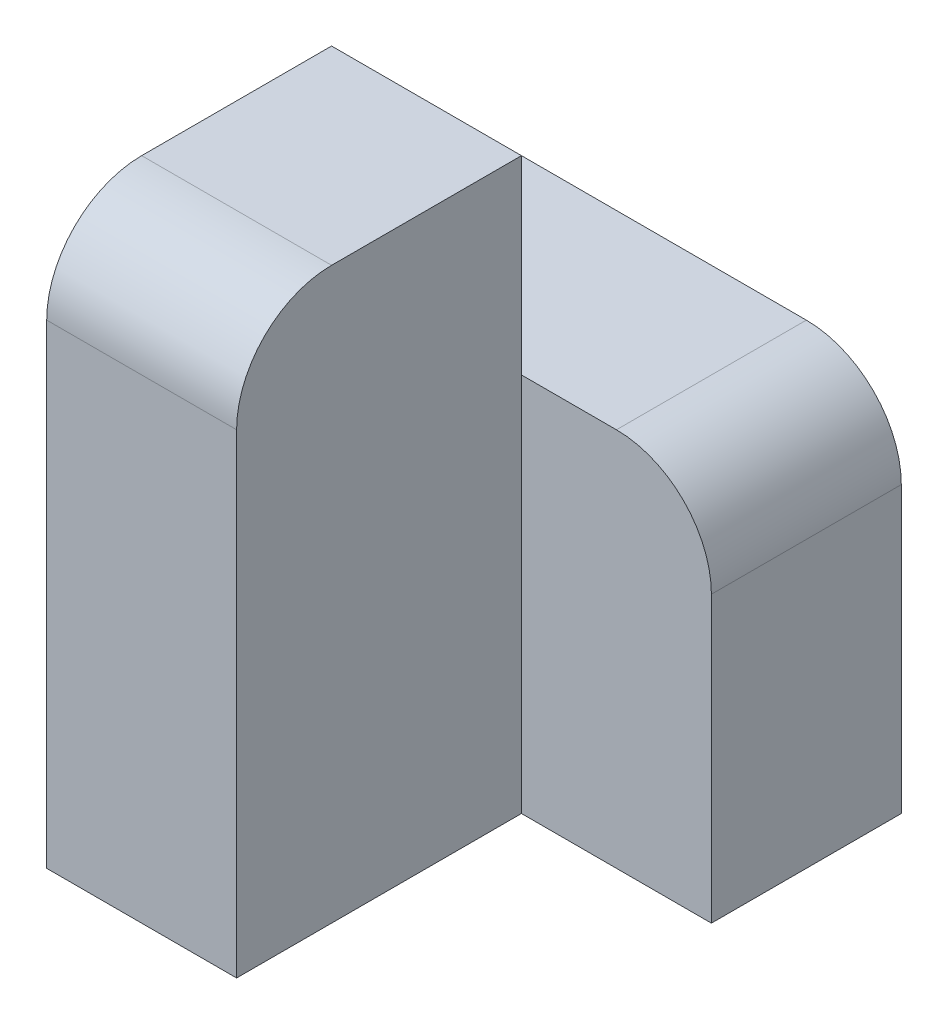
ISO-10303-21;
HEADER;
FILE_DESCRIPTION(('STEP AP214'),'2;1');
FILE_NAME('part.step','',(''),(''),'','','');
FILE_SCHEMA(('AUTOMOTIVE_DESIGN { 1 0 10303 214 1 1 1 1 }'));
ENDSEC;
DATA;
#1=APPLICATION_CONTEXT('core data for automotive mechanical design processes');
#2=APPLICATION_PROTOCOL_DEFINITION('international standard','automotive_design',2000,#1);
#3=PRODUCT_CONTEXT('',#1,'mechanical');
#4=PRODUCT('Part','Part','',(#3));
#5=PRODUCT_RELATED_PRODUCT_CATEGORY('part','',(#4));
#6=PRODUCT_DEFINITION_FORMATION('','',#4);
#7=PRODUCT_DEFINITION_CONTEXT('part definition',#1,'design');
#8=PRODUCT_DEFINITION('design','',#6,#7);
#9=PRODUCT_DEFINITION_SHAPE('','',#8);
#10=(LENGTH_UNIT() NAMED_UNIT(*) SI_UNIT(.MILLI.,.METRE.));
#11=(NAMED_UNIT(*) PLANE_ANGLE_UNIT() SI_UNIT($,.RADIAN.));
#12=(NAMED_UNIT(*) SI_UNIT($,.STERADIAN.) SOLID_ANGLE_UNIT());
#13=UNCERTAINTY_MEASURE_WITH_UNIT(LENGTH_MEASURE(1.E-05),#10,'distance_accuracy_value','');
#14=(GEOMETRIC_REPRESENTATION_CONTEXT(3) GLOBAL_UNCERTAINTY_ASSIGNED_CONTEXT((#13)) GLOBAL_UNIT_ASSIGNED_CONTEXT((#10,
#11,#12)) REPRESENTATION_CONTEXT('',''));
#15=CARTESIAN_POINT('',(0.,0.,0.));
#16=DIRECTION('',(0.,0.,1.));
#17=DIRECTION('',(1.,0.,0.));
#18=AXIS2_PLACEMENT_3D('',#15,#16,#17);
#19=CARTESIAN_POINT('',(-10.,0.,30.));
#20=DIRECTION('',(0.,-1.,0.));
#21=DIRECTION('',(1.,0.,0.));
#22=AXIS2_PLACEMENT_3D('',#19,#20,#21);
#23=PLANE('',#22);
#24=DIRECTION('',(0.,0.,-1.));
#25=VECTOR('',#24,1.);
#26=CARTESIAN_POINT('',(-30.,0.,30.));
#27=LINE('',#26,#25);
#28=CARTESIAN_POINT('',(-30.,0.,20.));
#29=VERTEX_POINT('',#28);
#30=CARTESIAN_POINT('',(-30.,0.,0.));
#31=VERTEX_POINT('',#30);
#32=EDGE_CURVE('E171',#29,#31,#27,.T.);
#33=ORIENTED_EDGE('',*,*,#32,.F.);
#34=DIRECTION('',(-1.,0.,0.));
#35=VECTOR('',#34,1.);
#36=CARTESIAN_POINT('',(-10.,0.,20.));
#37=LINE('',#36,#35);
#38=CARTESIAN_POINT('',(-10.,0.,20.));
#39=VERTEX_POINT('',#38);
#40=EDGE_CURVE('E43',#29,#39,#37,.F.);
#41=ORIENTED_EDGE('',*,*,#40,.T.);
#42=DIRECTION('',(0.,0.,-1.));
#43=VECTOR('',#42,1.);
#44=CARTESIAN_POINT('',(-10.,0.,30.));
#45=LINE('',#44,#43);
#46=CARTESIAN_POINT('',(-10.,0.,0.));
#47=VERTEX_POINT('',#46);
#48=EDGE_CURVE('E158',#39,#47,#45,.T.);
#49=ORIENTED_EDGE('',*,*,#48,.T.);
#50=DIRECTION('',(-1.,0.,0.));
#51=VECTOR('',#50,1.);
#52=CARTESIAN_POINT('',(-10.,0.,0.));
#53=LINE('',#52,#51);
#54=EDGE_CURVE('E148',#47,#31,#53,.T.);
#55=ORIENTED_EDGE('',*,*,#54,.T.);
#56=EDGE_LOOP('',(#33,#41,#49,#55));
#57=FACE_BOUND('',#56,.T.);
#58=ADVANCED_FACE('F35',(#57),#23,.F.);
#59=CARTESIAN_POINT('',(-30.,0.,30.));
#60=DIRECTION('',(1.,0.,0.));
#61=DIRECTION('',(0.,0.,-1.));
#62=AXIS2_PLACEMENT_3D('',#59,#60,#61);
#63=PLANE('',#62);
#64=DIRECTION('',(0.,-1.,0.));
#65=VECTOR('',#64,1.);
#66=CARTESIAN_POINT('',(-30.,0.,30.));
#67=LINE('',#66,#65);
#68=CARTESIAN_POINT('',(-30.,-10.,30.));
#69=VERTEX_POINT('',#68);
#70=CARTESIAN_POINT('',(-30.,-60.,30.));
#71=VERTEX_POINT('',#70);
#72=EDGE_CURVE('E150',#69,#71,#67,.T.);
#73=ORIENTED_EDGE('',*,*,#72,.F.);
#74=CARTESIAN_POINT('',(-30.,-10.,20.));
#75=DIRECTION('',(1.,0.,0.));
#76=DIRECTION('',(0.,0.,-1.));
#77=AXIS2_PLACEMENT_3D('',#74,#75,#76);
#78=CIRCLE('',#77,10.);
#79=EDGE_CURVE('E57',#69,#29,#78,.F.);
#80=ORIENTED_EDGE('',*,*,#79,.T.);
#81=ORIENTED_EDGE('',*,*,#32,.T.);
#82=DIRECTION('',(0.,-1.,0.));
#83=VECTOR('',#82,1.);
#84=CARTESIAN_POINT('',(-30.,0.,0.));
#85=LINE('',#84,#83);
#86=CARTESIAN_POINT('',(-30.,-20.,0.));
#87=VERTEX_POINT('',#86);
#88=EDGE_CURVE('E126',#31,#87,#85,.T.);
#89=ORIENTED_EDGE('',*,*,#88,.T.);
#90=DIRECTION('',(0.,0.,1.));
#91=VECTOR('',#90,1.);
#92=CARTESIAN_POINT('',(-30.,-20.,-20.));
#93=LINE('',#92,#91);
#94=CARTESIAN_POINT('',(-30.,-20.,-20.));
#95=VERTEX_POINT('',#94);
#96=EDGE_CURVE('E111',#95,#87,#93,.T.);
#97=ORIENTED_EDGE('',*,*,#96,.F.);
#98=DIRECTION('',(0.,-1.,0.));
#99=VECTOR('',#98,1.);
#100=CARTESIAN_POINT('',(-30.,-20.,-20.));
#101=LINE('',#100,#99);
#102=CARTESIAN_POINT('',(-30.,-60.,-20.));
#103=VERTEX_POINT('',#102);
#104=EDGE_CURVE('E118',#95,#103,#101,.T.);
#105=ORIENTED_EDGE('',*,*,#104,.T.);
#106=DIRECTION('',(0.,0.,-1.));
#107=VECTOR('',#106,1.);
#108=CARTESIAN_POINT('',(-30.,-60.,30.));
#109=LINE('',#108,#107);
#110=EDGE_CURVE('E169',#71,#103,#109,.T.);
#111=ORIENTED_EDGE('',*,*,#110,.F.);
#112=EDGE_LOOP('',(#73,#80,#81,#89,#97,#105,#111));
#113=FACE_BOUND('',#112,.T.);
#114=ADVANCED_FACE('F123',(#113),#63,.F.);
#115=CARTESIAN_POINT('',(-30.,-60.,30.));
#116=DIRECTION('',(0.,1.,0.));
#117=DIRECTION('',(0.,0.,1.));
#118=AXIS2_PLACEMENT_3D('',#115,#116,#117);
#119=PLANE('',#118);
#120=ORIENTED_EDGE('',*,*,#110,.T.);
#121=DIRECTION('',(1.,0.,0.));
#122=VECTOR('',#121,1.);
#123=CARTESIAN_POINT('',(-30.,-60.,-20.));
#124=LINE('',#123,#122);
#125=CARTESIAN_POINT('',(10.,-60.,-20.));
#126=VERTEX_POINT('',#125);
#127=EDGE_CURVE('E134',#103,#126,#124,.T.);
#128=ORIENTED_EDGE('',*,*,#127,.T.);
#129=DIRECTION('',(0.,0.,1.));
#130=VECTOR('',#129,1.);
#131=CARTESIAN_POINT('',(10.,-60.,-20.));
#132=LINE('',#131,#130);
#133=CARTESIAN_POINT('',(10.,-60.,0.));
#134=VERTEX_POINT('',#133);
#135=EDGE_CURVE('E127',#126,#134,#132,.T.);
#136=ORIENTED_EDGE('',*,*,#135,.T.);
#137=DIRECTION('',(1.,0.,0.));
#138=VECTOR('',#137,1.);
#139=CARTESIAN_POINT('',(-30.,-60.,0.));
#140=LINE('',#139,#138);
#141=CARTESIAN_POINT('',(-10.,-60.,0.));
#142=VERTEX_POINT('',#141);
#143=EDGE_CURVE('E142',#142,#134,#140,.T.);
#144=ORIENTED_EDGE('',*,*,#143,.F.);
#145=DIRECTION('',(0.,0.,-1.));
#146=VECTOR('',#145,1.);
#147=CARTESIAN_POINT('',(-10.,-60.,30.));
#148=LINE('',#147,#146);
#149=CARTESIAN_POINT('',(-10.,-60.,30.));
#150=VERTEX_POINT('',#149);
#151=EDGE_CURVE('E166',#150,#142,#148,.T.);
#152=ORIENTED_EDGE('',*,*,#151,.F.);
#153=DIRECTION('',(1.,0.,0.));
#154=VECTOR('',#153,1.);
#155=CARTESIAN_POINT('',(-30.,-60.,30.));
#156=LINE('',#155,#154);
#157=EDGE_CURVE('E152',#71,#150,#156,.T.);
#158=ORIENTED_EDGE('',*,*,#157,.F.);
#159=EDGE_LOOP('',(#120,#128,#136,#144,#152,#158));
#160=FACE_BOUND('',#159,.T.);
#161=ADVANCED_FACE('F193',(#160),#119,.F.);
#162=CARTESIAN_POINT('',(-10.,-60.,30.));
#163=DIRECTION('',(-1.,0.,0.));
#164=DIRECTION('',(0.,0.,1.));
#165=AXIS2_PLACEMENT_3D('',#162,#163,#164);
#166=PLANE('',#165);
#167=ORIENTED_EDGE('',*,*,#48,.F.);
#168=CARTESIAN_POINT('',(-10.,-10.,20.));
#169=DIRECTION('',(-1.,0.,0.));
#170=DIRECTION('',(0.,0.,1.));
#171=AXIS2_PLACEMENT_3D('',#168,#169,#170);
#172=CIRCLE('',#171,10.);
#173=CARTESIAN_POINT('',(-10.,-10.,30.));
#174=VERTEX_POINT('',#173);
#175=EDGE_CURVE('E11',#39,#174,#172,.F.);
#176=ORIENTED_EDGE('',*,*,#175,.T.);
#177=DIRECTION('',(0.,1.,0.));
#178=VECTOR('',#177,1.);
#179=CARTESIAN_POINT('',(-10.,-60.,30.));
#180=LINE('',#179,#178);
#181=EDGE_CURVE('E155',#150,#174,#180,.T.);
#182=ORIENTED_EDGE('',*,*,#181,.F.);
#183=ORIENTED_EDGE('',*,*,#151,.T.);
#184=DIRECTION('',(0.,1.,0.));
#185=VECTOR('',#184,1.);
#186=CARTESIAN_POINT('',(-10.,-60.,0.));
#187=LINE('',#186,#185);
#188=CARTESIAN_POINT('',(-10.,-20.,0.));
#189=VERTEX_POINT('',#188);
#190=EDGE_CURVE('E153',#142,#189,#187,.T.);
#191=ORIENTED_EDGE('',*,*,#190,.T.);
#192=EDGE_CURVE('E162',#189,#47,#187,.T.);
#193=ORIENTED_EDGE('',*,*,#192,.T.);
#194=EDGE_LOOP('',(#167,#176,#182,#183,#191,#193));
#195=FACE_BOUND('',#194,.T.);
#196=ADVANCED_FACE('F196',(#195),#166,.F.);
#197=CARTESIAN_POINT('',(0.,0.,30.));
#198=DIRECTION('',(0.,0.,1.));
#199=DIRECTION('',(1.,0.,0.));
#200=AXIS2_PLACEMENT_3D('',#197,#198,#199);
#201=PLANE('',#200);
#202=ORIENTED_EDGE('',*,*,#181,.T.);
#203=DIRECTION('',(-1.,0.,0.));
#204=VECTOR('',#203,1.);
#205=CARTESIAN_POINT('',(-30.,-10.,30.));
#206=LINE('',#205,#204);
#207=EDGE_CURVE('E181',#174,#69,#206,.T.);
#208=ORIENTED_EDGE('',*,*,#207,.T.);
#209=ORIENTED_EDGE('',*,*,#72,.T.);
#210=ORIENTED_EDGE('',*,*,#157,.T.);
#211=EDGE_LOOP('',(#202,#208,#209,#210));
#212=FACE_BOUND('',#211,.T.);
#213=ADVANCED_FACE('F186',(#212),#201,.T.);
#214=CARTESIAN_POINT('',(0.,0.,0.));
#215=DIRECTION('',(0.,0.,1.));
#216=DIRECTION('',(1.,0.,0.));
#217=AXIS2_PLACEMENT_3D('',#214,#215,#216);
#218=PLANE('',#217);
#219=ORIENTED_EDGE('',*,*,#192,.F.);
#220=DIRECTION('',(-1.,0.,0.));
#221=VECTOR('',#220,1.);
#222=CARTESIAN_POINT('',(10.,-20.,0.));
#223=LINE('',#222,#221);
#224=EDGE_CURVE('E143',#189,#87,#223,.T.);
#225=ORIENTED_EDGE('',*,*,#224,.T.);
#226=ORIENTED_EDGE('',*,*,#88,.F.);
#227=ORIENTED_EDGE('',*,*,#54,.F.);
#228=EDGE_LOOP('',(#219,#225,#226,#227));
#229=FACE_BOUND('',#228,.T.);
#230=ADVANCED_FACE('F215',(#229),#218,.F.);
#231=CARTESIAN_POINT('',(0.,0.,0.));
#232=DIRECTION('',(0.,0.,1.));
#233=DIRECTION('',(1.,0.,0.));
#234=AXIS2_PLACEMENT_3D('',#231,#232,#233);
#235=PLANE('',#234);
#236=DIRECTION('',(0.,1.,0.));
#237=VECTOR('',#236,1.);
#238=CARTESIAN_POINT('',(10.,-60.,0.));
#239=LINE('',#238,#237);
#240=CARTESIAN_POINT('',(10.,-30.,0.));
#241=VERTEX_POINT('',#240);
#242=EDGE_CURVE('E119',#134,#241,#239,.T.);
#243=ORIENTED_EDGE('',*,*,#242,.T.);
#244=CARTESIAN_POINT('',(0.,-30.,0.));
#245=DIRECTION('',(0.,0.,1.));
#246=DIRECTION('',(1.,0.,0.));
#247=AXIS2_PLACEMENT_3D('',#244,#245,#246);
#248=CIRCLE('',#247,10.);
#249=CARTESIAN_POINT('',(0.,-20.,0.));
#250=VERTEX_POINT('',#249);
#251=EDGE_CURVE('E176',#241,#250,#248,.T.);
#252=ORIENTED_EDGE('',*,*,#251,.T.);
#253=EDGE_CURVE('E140',#250,#189,#223,.T.);
#254=ORIENTED_EDGE('',*,*,#253,.T.);
#255=ORIENTED_EDGE('',*,*,#190,.F.);
#256=ORIENTED_EDGE('',*,*,#143,.T.);
#257=EDGE_LOOP('',(#243,#252,#254,#255,#256));
#258=FACE_BOUND('',#257,.T.);
#259=ADVANCED_FACE('F218',(#258),#235,.T.);
#260=CARTESIAN_POINT('',(10.,-20.,-20.));
#261=DIRECTION('',(0.,1.,0.));
#262=DIRECTION('',(0.,0.,1.));
#263=AXIS2_PLACEMENT_3D('',#260,#261,#262);
#264=PLANE('',#263);
#265=ORIENTED_EDGE('',*,*,#253,.F.);
#266=DIRECTION('',(0.,0.,1.));
#267=VECTOR('',#266,1.);
#268=CARTESIAN_POINT('',(0.,-20.,-20.));
#269=LINE('',#268,#267);
#270=CARTESIAN_POINT('',(0.,-20.,-20.));
#271=VERTEX_POINT('',#270);
#272=EDGE_CURVE('E114',#250,#271,#269,.F.);
#273=ORIENTED_EDGE('',*,*,#272,.T.);
#274=DIRECTION('',(-1.,0.,0.));
#275=VECTOR('',#274,1.);
#276=CARTESIAN_POINT('',(10.,-20.,-20.));
#277=LINE('',#276,#275);
#278=EDGE_CURVE('E106',#271,#95,#277,.T.);
#279=ORIENTED_EDGE('',*,*,#278,.T.);
#280=ORIENTED_EDGE('',*,*,#96,.T.);
#281=ORIENTED_EDGE('',*,*,#224,.F.);
#282=EDGE_LOOP('',(#265,#273,#279,#280,#281));
#283=FACE_BOUND('',#282,.T.);
#284=ADVANCED_FACE('F109',(#283),#264,.T.);
#285=CARTESIAN_POINT('',(10.,-60.,-20.));
#286=DIRECTION('',(1.,0.,0.));
#287=DIRECTION('',(0.,0.,-1.));
#288=AXIS2_PLACEMENT_3D('',#285,#286,#287);
#289=PLANE('',#288);
#290=DIRECTION('',(0.,1.,0.));
#291=VECTOR('',#290,1.);
#292=CARTESIAN_POINT('',(10.,-60.,-20.));
#293=LINE('',#292,#291);
#294=CARTESIAN_POINT('',(10.,-30.,-20.));
#295=VERTEX_POINT('',#294);
#296=EDGE_CURVE('E128',#126,#295,#293,.T.);
#297=ORIENTED_EDGE('',*,*,#296,.T.);
#298=DIRECTION('',(0.,0.,1.));
#299=VECTOR('',#298,1.);
#300=CARTESIAN_POINT('',(10.,-30.,-20.));
#301=LINE('',#300,#299);
#302=EDGE_CURVE('E173',#295,#241,#301,.T.);
#303=ORIENTED_EDGE('',*,*,#302,.T.);
#304=ORIENTED_EDGE('',*,*,#242,.F.);
#305=ORIENTED_EDGE('',*,*,#135,.F.);
#306=EDGE_LOOP('',(#297,#303,#304,#305));
#307=FACE_BOUND('',#306,.T.);
#308=ADVANCED_FACE('F224',(#307),#289,.T.);
#309=CARTESIAN_POINT('',(0.,0.,-20.));
#310=DIRECTION('',(0.,0.,1.));
#311=DIRECTION('',(1.,0.,0.));
#312=AXIS2_PLACEMENT_3D('',#309,#310,#311);
#313=PLANE('',#312);
#314=ORIENTED_EDGE('',*,*,#278,.F.);
#315=CARTESIAN_POINT('',(0.,-30.,-20.));
#316=DIRECTION('',(0.,0.,1.));
#317=DIRECTION('',(1.,0.,0.));
#318=AXIS2_PLACEMENT_3D('',#315,#316,#317);
#319=CIRCLE('',#318,10.);
#320=EDGE_CURVE('E179',#271,#295,#319,.F.);
#321=ORIENTED_EDGE('',*,*,#320,.T.);
#322=ORIENTED_EDGE('',*,*,#296,.F.);
#323=ORIENTED_EDGE('',*,*,#127,.F.);
#324=ORIENTED_EDGE('',*,*,#104,.F.);
#325=EDGE_LOOP('',(#314,#321,#322,#323,#324));
#326=FACE_BOUND('',#325,.T.);
#327=ADVANCED_FACE('F131',(#326),#313,.F.);
#328=CARTESIAN_POINT('',(0.,-30.,-20.));
#329=DIRECTION('',(0.,0.,1.));
#330=DIRECTION('',(1.,0.,0.));
#331=AXIS2_PLACEMENT_3D('',#328,#329,#330);
#332=CYLINDRICAL_SURFACE('',#331,10.);
#333=ORIENTED_EDGE('',*,*,#320,.F.);
#334=ORIENTED_EDGE('',*,*,#272,.F.);
#335=ORIENTED_EDGE('',*,*,#251,.F.);
#336=ORIENTED_EDGE('',*,*,#302,.F.);
#337=EDGE_LOOP('',(#333,#334,#335,#336));
#338=FACE_BOUND('',#337,.T.);
#339=ADVANCED_FACE('F199',(#338),#332,.T.);
#340=CARTESIAN_POINT('',(0.,-10.,20.));
#341=DIRECTION('',(1.,0.,0.));
#342=DIRECTION('',(0.,1.,0.));
#343=AXIS2_PLACEMENT_3D('',#340,#341,#342);
#344=CYLINDRICAL_SURFACE('',#343,10.);
#345=ORIENTED_EDGE('',*,*,#175,.F.);
#346=ORIENTED_EDGE('',*,*,#40,.F.);
#347=ORIENTED_EDGE('',*,*,#79,.F.);
#348=ORIENTED_EDGE('',*,*,#207,.F.);
#349=EDGE_LOOP('',(#345,#346,#347,#348));
#350=FACE_BOUND('',#349,.T.);
#351=ADVANCED_FACE('F37',(#350),#344,.T.);
#352=CLOSED_SHELL('',(#58,#114,#161,#196,#213,#230,#259,#284,#308,#327,#339,#351));
#353=MANIFOLD_SOLID_BREP('B2',#352);
#354=ADVANCED_BREP_SHAPE_REPRESENTATION('',(#18,#353),#14);
#355=SHAPE_DEFINITION_REPRESENTATION(#9,#354);
ENDSEC;
END-ISO-10303-21;
